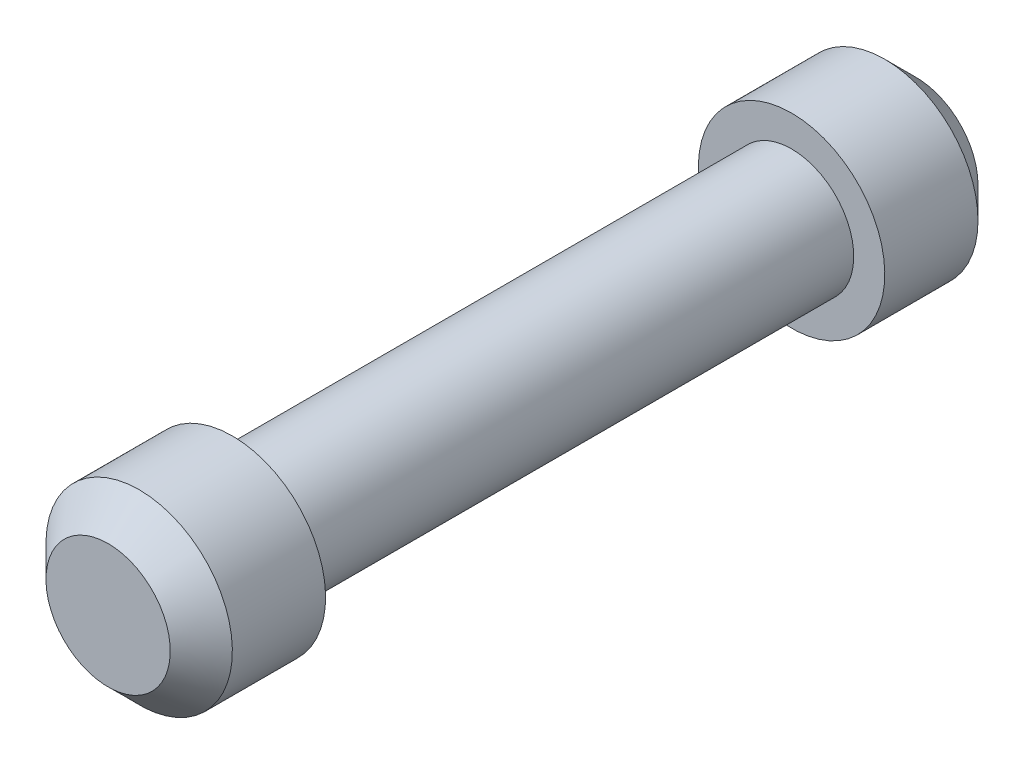
ISO-10303-21;
HEADER;
FILE_DESCRIPTION(('STEP AP214'),'2;1');
FILE_NAME('part.step','',(''),(''),'','','');
FILE_SCHEMA(('AUTOMOTIVE_DESIGN { 1 0 10303 214 1 1 1 1 }'));
ENDSEC;
DATA;
#1=APPLICATION_CONTEXT('core data for automotive mechanical design processes');
#2=APPLICATION_PROTOCOL_DEFINITION('international standard','automotive_design',2000,#1);
#3=PRODUCT_CONTEXT('',#1,'mechanical');
#4=PRODUCT('Part','Part','',(#3));
#5=PRODUCT_RELATED_PRODUCT_CATEGORY('part','',(#4));
#6=PRODUCT_DEFINITION_FORMATION('','',#4);
#7=PRODUCT_DEFINITION_CONTEXT('part definition',#1,'design');
#8=PRODUCT_DEFINITION('design','',#6,#7);
#9=PRODUCT_DEFINITION_SHAPE('','',#8);
#10=(LENGTH_UNIT() NAMED_UNIT(*) SI_UNIT(.MILLI.,.METRE.));
#11=(NAMED_UNIT(*) PLANE_ANGLE_UNIT() SI_UNIT($,.RADIAN.));
#12=(NAMED_UNIT(*) SI_UNIT($,.STERADIAN.) SOLID_ANGLE_UNIT());
#13=UNCERTAINTY_MEASURE_WITH_UNIT(LENGTH_MEASURE(1.E-05),#10,'distance_accuracy_value','');
#14=(GEOMETRIC_REPRESENTATION_CONTEXT(3) GLOBAL_UNCERTAINTY_ASSIGNED_CONTEXT((#13)) GLOBAL_UNIT_ASSIGNED_CONTEXT((#10,
#11,#12)) REPRESENTATION_CONTEXT('',''));
#15=CARTESIAN_POINT('',(0.,0.,0.));
#16=DIRECTION('',(0.,0.,1.));
#17=DIRECTION('',(1.,0.,0.));
#18=AXIS2_PLACEMENT_3D('',#15,#16,#17);
#19=CARTESIAN_POINT('',(0.,0.,0.));
#20=DIRECTION('',(0.,0.,1.));
#21=DIRECTION('',(0.,-1.,0.));
#22=AXIS2_PLACEMENT_3D('',#19,#20,#21);
#23=PLANE('',#22);
#24=CARTESIAN_POINT('',(0.,0.,-5.6843418860808E-11));
#25=DIRECTION('',(0.,0.,-1.));
#26=DIRECTION('',(0.,1.,0.));
#27=AXIS2_PLACEMENT_3D('',#24,#25,#26);
#28=CIRCLE('',#27,1.0000000000332);
#29=CARTESIAN_POINT('',(0.,1.0000000000332,-5.68433827207356E-11));
#30=VERTEX_POINT('',#29);
#31=EDGE_CURVE('E17',#30,#30,#28,.T.);
#32=ORIENTED_EDGE('',*,*,#31,.F.);
#33=EDGE_LOOP('',(#32));
#34=FACE_BOUND('',#33,.T.);
#35=ADVANCED_FACE('F14',(#34),#23,.T.);
#36=CARTESIAN_POINT('',(0.,1.,-13.));
#37=DIRECTION('',(0.,0.,-1.));
#38=DIRECTION('',(0.,1.,0.));
#39=AXIS2_PLACEMENT_3D('',#36,#37,#38);
#40=PLANE('',#39);
#41=CARTESIAN_POINT('',(0.,0.,-12.9999999999768));
#42=DIRECTION('',(0.,0.,1.));
#43=DIRECTION('',(1.,0.,0.));
#44=AXIS2_PLACEMENT_3D('',#41,#42,#43);
#45=CIRCLE('',#44,0.999999999976354);
#46=CARTESIAN_POINT('',(0.999999999976354,0.,-12.9999999999768));
#47=VERTEX_POINT('',#46);
#48=EDGE_CURVE('E37',#47,#47,#45,.T.);
#49=ORIENTED_EDGE('',*,*,#48,.F.);
#50=EDGE_LOOP('',(#49));
#51=FACE_BOUND('',#50,.T.);
#52=ADVANCED_FACE('F49',(#51),#40,.T.);
#53=CARTESIAN_POINT('',(0.,0.,-0.499999999931333));
#54=DIRECTION('',(0.,0.,-1.));
#55=DIRECTION('',(0.,1.,0.));
#56=AXIS2_PLACEMENT_3D('',#53,#54,#55);
#57=CONICAL_SURFACE('',#56,1.49999999990769,0.785398163397448);
#58=ORIENTED_EDGE('',*,*,#31,.T.);
#59=EDGE_LOOP('',(#58));
#60=FACE_BOUND('',#59,.T.);
#61=CARTESIAN_POINT('',(0.,0.,-0.5));
#62=DIRECTION('',(0.,0.,-1.));
#63=DIRECTION('',(0.,1.,0.));
#64=AXIS2_PLACEMENT_3D('',#61,#62,#63);
#65=CIRCLE('',#64,1.5);
#66=CARTESIAN_POINT('',(0.,1.5,-0.5));
#67=VERTEX_POINT('',#66);
#68=EDGE_CURVE('E29',#67,#67,#65,.T.);
#69=ORIENTED_EDGE('',*,*,#68,.F.);
#70=EDGE_LOOP('',(#69));
#71=FACE_BOUND('',#70,.T.);
#72=ADVANCED_FACE('F45',(#60,#71),#57,.T.);
#73=CARTESIAN_POINT('',(0.,0.,-12.5000000000455));
#74=DIRECTION('',(0.,0.,1.));
#75=DIRECTION('',(1.,0.,0.));
#76=AXIS2_PLACEMENT_3D('',#73,#74,#75);
#77=CONICAL_SURFACE('',#76,1.49999999990769,0.785398163397448);
#78=ORIENTED_EDGE('',*,*,#48,.T.);
#79=EDGE_LOOP('',(#78));
#80=FACE_BOUND('',#79,.T.);
#81=CARTESIAN_POINT('',(0.,0.,-12.5));
#82=DIRECTION('',(0.,0.,-1.));
#83=DIRECTION('',(0.,1.,0.));
#84=AXIS2_PLACEMENT_3D('',#81,#82,#83);
#85=CIRCLE('',#84,1.5);
#86=CARTESIAN_POINT('',(0.,1.5,-12.5));
#87=VERTEX_POINT('',#86);
#88=EDGE_CURVE('E36',#87,#87,#85,.F.);
#89=ORIENTED_EDGE('',*,*,#88,.F.);
#90=EDGE_LOOP('',(#89));
#91=FACE_BOUND('',#90,.T.);
#92=ADVANCED_FACE('F78',(#80,#91),#77,.T.);
#93=CARTESIAN_POINT('',(0.,0.,-13.));
#94=DIRECTION('',(0.,0.,-1.));
#95=DIRECTION('',(0.,1.,0.));
#96=AXIS2_PLACEMENT_3D('',#93,#94,#95);
#97=CYLINDRICAL_SURFACE('',#96,1.5);
#98=ORIENTED_EDGE('',*,*,#68,.T.);
#99=EDGE_LOOP('',(#98));
#100=FACE_BOUND('',#99,.T.);
#101=CARTESIAN_POINT('',(0.,0.,-2.));
#102=DIRECTION('',(0.,0.,-1.));
#103=DIRECTION('',(0.,1.,0.));
#104=AXIS2_PLACEMENT_3D('',#101,#102,#103);
#105=CIRCLE('',#104,1.5);
#106=CARTESIAN_POINT('',(0.,1.5,-2.));
#107=VERTEX_POINT('',#106);
#108=EDGE_CURVE('E34',#107,#107,#105,.T.);
#109=ORIENTED_EDGE('',*,*,#108,.F.);
#110=EDGE_LOOP('',(#109));
#111=FACE_BOUND('',#110,.T.);
#112=ADVANCED_FACE('F74',(#100,#111),#97,.T.);
#113=CARTESIAN_POINT('',(0.,0.,-13.));
#114=DIRECTION('',(0.,0.,-1.));
#115=DIRECTION('',(0.,1.,0.));
#116=AXIS2_PLACEMENT_3D('',#113,#114,#115);
#117=CYLINDRICAL_SURFACE('',#116,1.5);
#118=CARTESIAN_POINT('',(0.,0.,-11.));
#119=DIRECTION('',(0.,0.,-1.));
#120=DIRECTION('',(0.,1.,0.));
#121=AXIS2_PLACEMENT_3D('',#118,#119,#120);
#122=CIRCLE('',#121,1.5);
#123=CARTESIAN_POINT('',(0.,1.5,-11.));
#124=VERTEX_POINT('',#123);
#125=EDGE_CURVE('E26',#124,#124,#122,.F.);
#126=ORIENTED_EDGE('',*,*,#125,.F.);
#127=EDGE_LOOP('',(#126));
#128=FACE_BOUND('',#127,.T.);
#129=ORIENTED_EDGE('',*,*,#88,.T.);
#130=EDGE_LOOP('',(#129));
#131=FACE_BOUND('',#130,.T.);
#132=ADVANCED_FACE('F70',(#128,#131),#117,.T.);
#133=CARTESIAN_POINT('',(0.,1.5,-2.));
#134=DIRECTION('',(0.,0.,-1.));
#135=DIRECTION('',(0.,1.,0.));
#136=AXIS2_PLACEMENT_3D('',#133,#134,#135);
#137=PLANE('',#136);
#138=CARTESIAN_POINT('',(0.,0.,-2.));
#139=DIRECTION('',(0.,0.,-1.));
#140=DIRECTION('',(0.,1.,0.));
#141=AXIS2_PLACEMENT_3D('',#138,#139,#140);
#142=CIRCLE('',#141,1.);
#143=CARTESIAN_POINT('',(0.,1.,-2.));
#144=VERTEX_POINT('',#143);
#145=EDGE_CURVE('E21',#144,#144,#142,.T.);
#146=ORIENTED_EDGE('',*,*,#145,.F.);
#147=EDGE_LOOP('',(#146));
#148=FACE_BOUND('',#147,.T.);
#149=ORIENTED_EDGE('',*,*,#108,.T.);
#150=EDGE_LOOP('',(#149));
#151=FACE_BOUND('',#150,.T.);
#152=ADVANCED_FACE('F63',(#148,#151),#137,.T.);
#153=CARTESIAN_POINT('',(0.,1.,-11.));
#154=DIRECTION('',(0.,0.,1.));
#155=DIRECTION('',(0.,-1.,0.));
#156=AXIS2_PLACEMENT_3D('',#153,#154,#155);
#157=PLANE('',#156);
#158=ORIENTED_EDGE('',*,*,#125,.T.);
#159=EDGE_LOOP('',(#158));
#160=FACE_BOUND('',#159,.T.);
#161=CARTESIAN_POINT('',(0.,0.,-11.));
#162=DIRECTION('',(0.,0.,-1.));
#163=DIRECTION('',(0.,1.,0.));
#164=AXIS2_PLACEMENT_3D('',#161,#162,#163);
#165=CIRCLE('',#164,1.);
#166=CARTESIAN_POINT('',(0.,1.,-11.));
#167=VERTEX_POINT('',#166);
#168=EDGE_CURVE('E10',#167,#167,#165,.F.);
#169=ORIENTED_EDGE('',*,*,#168,.F.);
#170=EDGE_LOOP('',(#169));
#171=FACE_BOUND('',#170,.T.);
#172=ADVANCED_FACE('F57',(#160,#171),#157,.T.);
#173=CARTESIAN_POINT('',(0.,0.,-13.));
#174=DIRECTION('',(0.,0.,-1.));
#175=DIRECTION('',(0.,1.,0.));
#176=AXIS2_PLACEMENT_3D('',#173,#174,#175);
#177=CYLINDRICAL_SURFACE('',#176,1.);
#178=ORIENTED_EDGE('',*,*,#168,.T.);
#179=EDGE_LOOP('',(#178));
#180=FACE_BOUND('',#179,.T.);
#181=ORIENTED_EDGE('',*,*,#145,.T.);
#182=EDGE_LOOP('',(#181));
#183=FACE_BOUND('',#182,.T.);
#184=ADVANCED_FACE('F55',(#180,#183),#177,.T.);
#185=CLOSED_SHELL('',(#35,#52,#72,#92,#112,#132,#152,#172,#184));
#186=MANIFOLD_SOLID_BREP('B1',#185);
#187=ADVANCED_BREP_SHAPE_REPRESENTATION('',(#18,#186),#14);
#188=SHAPE_DEFINITION_REPRESENTATION(#9,#187);
ENDSEC;
END-ISO-10303-21;
